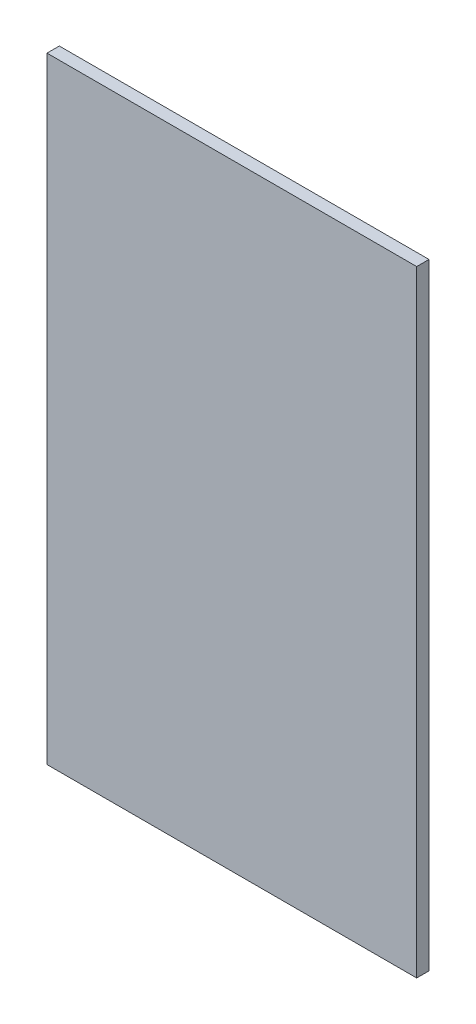
ISO-10303-21;
HEADER;
FILE_DESCRIPTION(('STEP AP214'),'2;1');
FILE_NAME('part.step','',(''),(''),'','','');
FILE_SCHEMA(('AUTOMOTIVE_DESIGN { 1 0 10303 214 1 1 1 1 }'));
ENDSEC;
DATA;
#1=APPLICATION_CONTEXT('core data for automotive mechanical design processes');
#2=APPLICATION_PROTOCOL_DEFINITION('international standard','automotive_design',2000,#1);
#3=PRODUCT_CONTEXT('',#1,'mechanical');
#4=PRODUCT('Part','Part','',(#3));
#5=PRODUCT_RELATED_PRODUCT_CATEGORY('part','',(#4));
#6=PRODUCT_DEFINITION_FORMATION('','',#4);
#7=PRODUCT_DEFINITION_CONTEXT('part definition',#1,'design');
#8=PRODUCT_DEFINITION('design','',#6,#7);
#9=PRODUCT_DEFINITION_SHAPE('','',#8);
#10=(LENGTH_UNIT() NAMED_UNIT(*) SI_UNIT(.MILLI.,.METRE.));
#11=(NAMED_UNIT(*) PLANE_ANGLE_UNIT() SI_UNIT($,.RADIAN.));
#12=(NAMED_UNIT(*) SI_UNIT($,.STERADIAN.) SOLID_ANGLE_UNIT());
#13=UNCERTAINTY_MEASURE_WITH_UNIT(LENGTH_MEASURE(1.E-05),#10,'distance_accuracy_value','');
#14=(GEOMETRIC_REPRESENTATION_CONTEXT(3) GLOBAL_UNCERTAINTY_ASSIGNED_CONTEXT((#13)) GLOBAL_UNIT_ASSIGNED_CONTEXT((#10,
#11,#12)) REPRESENTATION_CONTEXT('',''));
#15=CARTESIAN_POINT('',(0.,0.,0.));
#16=DIRECTION('',(0.,0.,1.));
#17=DIRECTION('',(1.,0.,0.));
#18=AXIS2_PLACEMENT_3D('',#15,#16,#17);
#19=CARTESIAN_POINT('',(0.,0.,10.));
#20=DIRECTION('',(1.,0.,0.));
#21=DIRECTION('',(0.,0.,-1.));
#22=AXIS2_PLACEMENT_3D('',#19,#20,#21);
#23=PLANE('',#22);
#24=DIRECTION('',(0.,-1.,0.));
#25=VECTOR('',#24,1.);
#26=CARTESIAN_POINT('',(0.,0.,0.));
#27=LINE('',#26,#25);
#28=CARTESIAN_POINT('',(0.,500.,0.));
#29=VERTEX_POINT('',#28);
#30=CARTESIAN_POINT('',(0.,0.,0.));
#31=VERTEX_POINT('',#30);
#32=EDGE_CURVE('E94',#29,#31,#27,.T.);
#33=ORIENTED_EDGE('',*,*,#32,.T.);
#34=DIRECTION('',(0.,0.,-1.));
#35=VECTOR('',#34,1.);
#36=CARTESIAN_POINT('',(0.,0.,10.));
#37=LINE('',#36,#35);
#38=CARTESIAN_POINT('',(0.,0.,10.));
#39=VERTEX_POINT('',#38);
#40=EDGE_CURVE('E11',#39,#31,#37,.T.);
#41=ORIENTED_EDGE('',*,*,#40,.F.);
#42=DIRECTION('',(0.,-1.,0.));
#43=VECTOR('',#42,1.);
#44=CARTESIAN_POINT('',(0.,0.,10.));
#45=LINE('',#44,#43);
#46=CARTESIAN_POINT('',(0.,500.,10.));
#47=VERTEX_POINT('',#46);
#48=EDGE_CURVE('E82',#47,#39,#45,.T.);
#49=ORIENTED_EDGE('',*,*,#48,.F.);
#50=DIRECTION('',(0.,0.,-1.));
#51=VECTOR('',#50,1.);
#52=CARTESIAN_POINT('',(0.,500.,10.));
#53=LINE('',#52,#51);
#54=EDGE_CURVE('E90',#47,#29,#53,.T.);
#55=ORIENTED_EDGE('',*,*,#54,.T.);
#56=EDGE_LOOP('',(#33,#41,#49,#55));
#57=FACE_BOUND('',#56,.T.);
#58=ADVANCED_FACE('F31',(#57),#23,.F.);
#59=CARTESIAN_POINT('',(0.,0.,10.));
#60=DIRECTION('',(0.,1.,0.));
#61=DIRECTION('',(0.,0.,1.));
#62=AXIS2_PLACEMENT_3D('',#59,#60,#61);
#63=PLANE('',#62);
#64=DIRECTION('',(1.,0.,0.));
#65=VECTOR('',#64,1.);
#66=CARTESIAN_POINT('',(0.,0.,0.));
#67=LINE('',#66,#65);
#68=CARTESIAN_POINT('',(300.,0.,0.));
#69=VERTEX_POINT('',#68);
#70=EDGE_CURVE('E86',#31,#69,#67,.T.);
#71=ORIENTED_EDGE('',*,*,#70,.T.);
#72=DIRECTION('',(0.,0.,-1.));
#73=VECTOR('',#72,1.);
#74=CARTESIAN_POINT('',(300.,0.,10.));
#75=LINE('',#74,#73);
#76=CARTESIAN_POINT('',(300.,0.,10.));
#77=VERTEX_POINT('',#76);
#78=EDGE_CURVE('E39',#77,#69,#75,.T.);
#79=ORIENTED_EDGE('',*,*,#78,.F.);
#80=DIRECTION('',(1.,0.,0.));
#81=VECTOR('',#80,1.);
#82=CARTESIAN_POINT('',(0.,0.,10.));
#83=LINE('',#82,#81);
#84=EDGE_CURVE('E77',#39,#77,#83,.T.);
#85=ORIENTED_EDGE('',*,*,#84,.F.);
#86=ORIENTED_EDGE('',*,*,#40,.T.);
#87=EDGE_LOOP('',(#71,#79,#85,#86));
#88=FACE_BOUND('',#87,.T.);
#89=ADVANCED_FACE('F85',(#88),#63,.F.);
#90=CARTESIAN_POINT('',(300.,0.,10.));
#91=DIRECTION('',(-1.,0.,0.));
#92=DIRECTION('',(0.,0.,1.));
#93=AXIS2_PLACEMENT_3D('',#90,#91,#92);
#94=PLANE('',#93);
#95=DIRECTION('',(0.,1.,0.));
#96=VECTOR('',#95,1.);
#97=CARTESIAN_POINT('',(300.,0.,0.));
#98=LINE('',#97,#96);
#99=CARTESIAN_POINT('',(300.,500.,0.));
#100=VERTEX_POINT('',#99);
#101=EDGE_CURVE('E64',#69,#100,#98,.T.);
#102=ORIENTED_EDGE('',*,*,#101,.T.);
#103=DIRECTION('',(0.,0.,-1.));
#104=VECTOR('',#103,1.);
#105=CARTESIAN_POINT('',(300.,500.,10.));
#106=LINE('',#105,#104);
#107=CARTESIAN_POINT('',(300.,500.,10.));
#108=VERTEX_POINT('',#107);
#109=EDGE_CURVE('E87',#108,#100,#106,.T.);
#110=ORIENTED_EDGE('',*,*,#109,.F.);
#111=DIRECTION('',(0.,1.,0.));
#112=VECTOR('',#111,1.);
#113=CARTESIAN_POINT('',(300.,0.,10.));
#114=LINE('',#113,#112);
#115=EDGE_CURVE('E80',#77,#108,#114,.T.);
#116=ORIENTED_EDGE('',*,*,#115,.F.);
#117=ORIENTED_EDGE('',*,*,#78,.T.);
#118=EDGE_LOOP('',(#102,#110,#116,#117));
#119=FACE_BOUND('',#118,.T.);
#120=ADVANCED_FACE('F88',(#119),#94,.F.);
#121=CARTESIAN_POINT('',(0.,500.,10.));
#122=DIRECTION('',(0.,-1.,0.));
#123=DIRECTION('',(0.,0.,-1.));
#124=AXIS2_PLACEMENT_3D('',#121,#122,#123);
#125=PLANE('',#124);
#126=DIRECTION('',(-1.,0.,0.));
#127=VECTOR('',#126,1.);
#128=CARTESIAN_POINT('',(0.,500.,0.));
#129=LINE('',#128,#127);
#130=EDGE_CURVE('E70',#100,#29,#129,.T.);
#131=ORIENTED_EDGE('',*,*,#130,.T.);
#132=ORIENTED_EDGE('',*,*,#54,.F.);
#133=DIRECTION('',(-1.,0.,0.));
#134=VECTOR('',#133,1.);
#135=CARTESIAN_POINT('',(0.,500.,10.));
#136=LINE('',#135,#134);
#137=EDGE_CURVE('E47',#108,#47,#136,.T.);
#138=ORIENTED_EDGE('',*,*,#137,.F.);
#139=ORIENTED_EDGE('',*,*,#109,.T.);
#140=EDGE_LOOP('',(#131,#132,#138,#139));
#141=FACE_BOUND('',#140,.T.);
#142=ADVANCED_FACE('F101',(#141),#125,.F.);
#143=CARTESIAN_POINT('',(0.,500.,10.));
#144=DIRECTION('',(0.,0.,-1.));
#145=DIRECTION('',(-1.,0.,0.));
#146=AXIS2_PLACEMENT_3D('',#143,#144,#145);
#147=PLANE('',#146);
#148=ORIENTED_EDGE('',*,*,#48,.T.);
#149=ORIENTED_EDGE('',*,*,#84,.T.);
#150=ORIENTED_EDGE('',*,*,#115,.T.);
#151=ORIENTED_EDGE('',*,*,#137,.T.);
#152=EDGE_LOOP('',(#148,#149,#150,#151));
#153=FACE_BOUND('',#152,.T.);
#154=ADVANCED_FACE('F78',(#153),#147,.F.);
#155=CARTESIAN_POINT('',(0.,500.,0.));
#156=DIRECTION('',(0.,0.,-1.));
#157=DIRECTION('',(-1.,0.,0.));
#158=AXIS2_PLACEMENT_3D('',#155,#156,#157);
#159=PLANE('',#158);
#160=ORIENTED_EDGE('',*,*,#32,.F.);
#161=ORIENTED_EDGE('',*,*,#130,.F.);
#162=ORIENTED_EDGE('',*,*,#101,.F.);
#163=ORIENTED_EDGE('',*,*,#70,.F.);
#164=EDGE_LOOP('',(#160,#161,#162,#163));
#165=FACE_BOUND('',#164,.T.);
#166=ADVANCED_FACE('F104',(#165),#159,.T.);
#167=CLOSED_SHELL('',(#58,#89,#120,#142,#154,#166));
#168=MANIFOLD_SOLID_BREP('B2',#167);
#169=ADVANCED_BREP_SHAPE_REPRESENTATION('',(#18,#168),#14);
#170=SHAPE_DEFINITION_REPRESENTATION(#9,#169);
ENDSEC;
END-ISO-10303-21;
